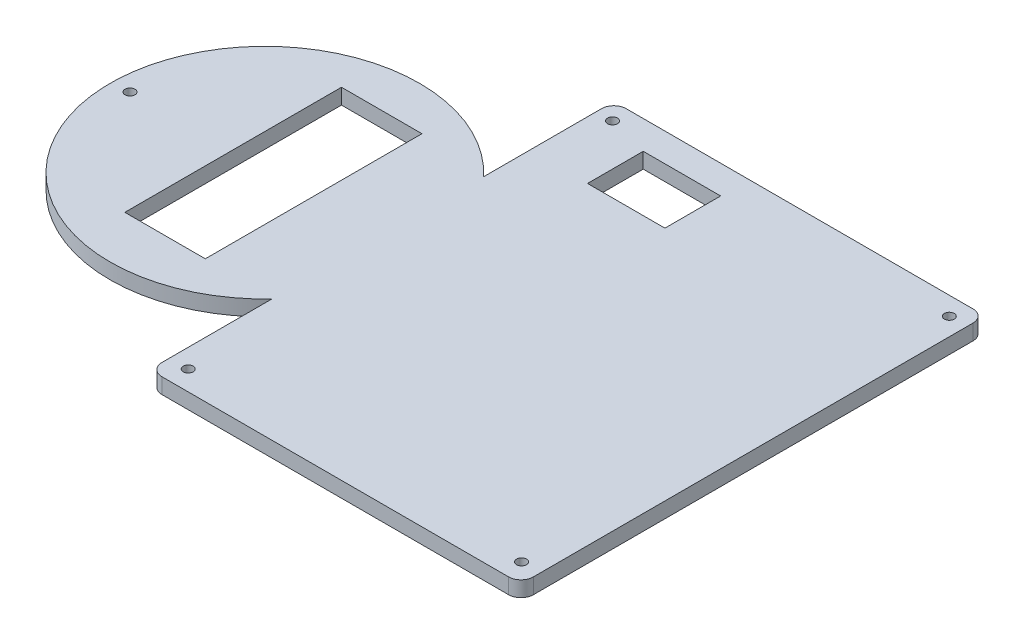
ISO-10303-21;
HEADER;
FILE_DESCRIPTION(('STEP AP214'),'2;1');
FILE_NAME('part.step','',(''),(''),'','','');
FILE_SCHEMA(('AUTOMOTIVE_DESIGN { 1 0 10303 214 1 1 1 1 }'));
ENDSEC;
DATA;
#1=APPLICATION_CONTEXT('core data for automotive mechanical design processes');
#2=APPLICATION_PROTOCOL_DEFINITION('international standard','automotive_design',2000,#1);
#3=PRODUCT_CONTEXT('',#1,'mechanical');
#4=PRODUCT('Part','Part','',(#3));
#5=PRODUCT_RELATED_PRODUCT_CATEGORY('part','',(#4));
#6=PRODUCT_DEFINITION_FORMATION('','',#4);
#7=PRODUCT_DEFINITION_CONTEXT('part definition',#1,'design');
#8=PRODUCT_DEFINITION('design','',#6,#7);
#9=PRODUCT_DEFINITION_SHAPE('','',#8);
#10=(LENGTH_UNIT() NAMED_UNIT(*) SI_UNIT(.MILLI.,.METRE.));
#11=(NAMED_UNIT(*) PLANE_ANGLE_UNIT() SI_UNIT($,.RADIAN.));
#12=(NAMED_UNIT(*) SI_UNIT($,.STERADIAN.) SOLID_ANGLE_UNIT());
#13=UNCERTAINTY_MEASURE_WITH_UNIT(LENGTH_MEASURE(1.E-05),#10,'distance_accuracy_value','');
#14=(GEOMETRIC_REPRESENTATION_CONTEXT(3) GLOBAL_UNCERTAINTY_ASSIGNED_CONTEXT((#13)) GLOBAL_UNIT_ASSIGNED_CONTEXT((#10,
#11,#12)) REPRESENTATION_CONTEXT('',''));
#15=CARTESIAN_POINT('',(0.,0.,0.));
#16=DIRECTION('',(0.,0.,1.));
#17=DIRECTION('',(1.,0.,0.));
#18=AXIS2_PLACEMENT_3D('',#15,#16,#17);
#19=CARTESIAN_POINT('',(13.7088550827018,5.,-147.164227743625));
#20=DIRECTION('',(1.,0.,0.));
#21=DIRECTION('',(0.,0.,-1.));
#22=AXIS2_PLACEMENT_3D('',#19,#20,#21);
#23=PLANE('',#22);
#24=DIRECTION('',(0.,0.,1.));
#25=VECTOR('',#24,1.);
#26=CARTESIAN_POINT('',(13.7088550827018,0.,-147.164227743625));
#27=LINE('',#26,#25);
#28=CARTESIAN_POINT('',(13.7088550827018,0.,-36.700917177434));
#29=VERTEX_POINT('',#28);
#30=CARTESIAN_POINT('',(13.7088550827018,0.,-1.16422774362512));
#31=VERTEX_POINT('',#30);
#32=EDGE_CURVE('E259',#29,#31,#27,.T.);
#33=ORIENTED_EDGE('',*,*,#32,.T.);
#34=DIRECTION('',(0.,-1.,0.));
#35=VECTOR('',#34,1.);
#36=CARTESIAN_POINT('',(13.7088550827018,5.,-1.16422774362512));
#37=LINE('',#36,#35);
#38=CARTESIAN_POINT('',(13.7088550827018,5.,-1.16422774362512));
#39=VERTEX_POINT('',#38);
#40=EDGE_CURVE('E318',#31,#39,#37,.F.);
#41=ORIENTED_EDGE('',*,*,#40,.T.);
#42=DIRECTION('',(0.,0.,1.));
#43=VECTOR('',#42,1.);
#44=CARTESIAN_POINT('',(13.7088550827018,5.,-147.164227743625));
#45=LINE('',#44,#43);
#46=CARTESIAN_POINT('',(13.7088550827018,5.,-36.700917177434));
#47=VERTEX_POINT('',#46);
#48=EDGE_CURVE('E263',#47,#39,#45,.T.);
#49=ORIENTED_EDGE('',*,*,#48,.F.);
#50=DIRECTION('',(0.,-1.,0.));
#51=VECTOR('',#50,1.);
#52=CARTESIAN_POINT('',(13.7088550827018,5.,-36.700917177434));
#53=LINE('',#52,#51);
#54=EDGE_CURVE('E256',#29,#47,#53,.F.);
#55=ORIENTED_EDGE('',*,*,#54,.F.);
#56=EDGE_LOOP('',(#33,#41,#49,#55));
#57=FACE_BOUND('',#56,.T.);
#58=ADVANCED_FACE('F36',(#57),#23,.F.);
#59=CARTESIAN_POINT('',(13.7088550827018,5.,-143.164227743625));
#60=VERTEX_POINT('',#59);
#61=CARTESIAN_POINT('',(13.7088550827018,5.,-105.071550558676));
#62=VERTEX_POINT('',#61);
#63=EDGE_CURVE('E260',#60,#62,#45,.T.);
#64=ORIENTED_EDGE('',*,*,#63,.F.);
#65=DIRECTION('',(0.,-1.,0.));
#66=VECTOR('',#65,1.);
#67=CARTESIAN_POINT('',(13.7088550827018,0.,-143.164227743625));
#68=LINE('',#67,#66);
#69=CARTESIAN_POINT('',(13.7088550827018,0.,-143.164227743625));
#70=VERTEX_POINT('',#69);
#71=EDGE_CURVE('E320',#60,#70,#68,.T.);
#72=ORIENTED_EDGE('',*,*,#71,.T.);
#73=CARTESIAN_POINT('',(13.7088550827018,0.,-105.071550558676));
#74=VERTEX_POINT('',#73);
#75=EDGE_CURVE('E273',#70,#74,#27,.T.);
#76=ORIENTED_EDGE('',*,*,#75,.T.);
#77=DIRECTION('',(0.,-1.,0.));
#78=VECTOR('',#77,1.);
#79=CARTESIAN_POINT('',(13.7088550827018,5.,-105.071550558676));
#80=LINE('',#79,#78);
#81=EDGE_CURVE('E250',#62,#74,#80,.T.);
#82=ORIENTED_EDGE('',*,*,#81,.F.);
#83=EDGE_LOOP('',(#64,#72,#76,#82));
#84=FACE_BOUND('',#83,.T.);
#85=ADVANCED_FACE('F359',(#84),#23,.F.);
#86=CARTESIAN_POINT('',(13.7088550827018,5.,2.83577225637488));
#87=DIRECTION('',(0.,0.,-1.));
#88=DIRECTION('',(-1.,0.,0.));
#89=AXIS2_PLACEMENT_3D('',#86,#87,#88);
#90=PLANE('',#89);
#91=DIRECTION('',(1.,0.,0.));
#92=VECTOR('',#91,1.);
#93=CARTESIAN_POINT('',(13.7088550827018,0.,2.83577225637488));
#94=LINE('',#93,#92);
#95=CARTESIAN_POINT('',(17.7088550827018,0.,2.83577225637488));
#96=VERTEX_POINT('',#95);
#97=CARTESIAN_POINT('',(129.708855082702,0.,2.83577225637488));
#98=VERTEX_POINT('',#97);
#99=EDGE_CURVE('E275',#96,#98,#94,.T.);
#100=ORIENTED_EDGE('',*,*,#99,.T.);
#101=DIRECTION('',(0.,-1.,0.));
#102=VECTOR('',#101,1.);
#103=CARTESIAN_POINT('',(129.708855082702,5.,2.83577225637488));
#104=LINE('',#103,#102);
#105=CARTESIAN_POINT('',(129.708855082702,5.,2.83577225637488));
#106=VERTEX_POINT('',#105);
#107=EDGE_CURVE('E303',#98,#106,#104,.F.);
#108=ORIENTED_EDGE('',*,*,#107,.T.);
#109=DIRECTION('',(1.,0.,0.));
#110=VECTOR('',#109,1.);
#111=CARTESIAN_POINT('',(13.7088550827018,5.,2.83577225637488));
#112=LINE('',#111,#110);
#113=CARTESIAN_POINT('',(17.7088550827018,5.,2.83577225637488));
#114=VERTEX_POINT('',#113);
#115=EDGE_CURVE('E262',#114,#106,#112,.T.);
#116=ORIENTED_EDGE('',*,*,#115,.F.);
#117=DIRECTION('',(0.,-1.,0.));
#118=VECTOR('',#117,1.);
#119=CARTESIAN_POINT('',(17.7088550827018,5.,2.83577225637488));
#120=LINE('',#119,#118);
#121=EDGE_CURVE('E300',#114,#96,#120,.T.);
#122=ORIENTED_EDGE('',*,*,#121,.T.);
#123=EDGE_LOOP('',(#100,#108,#116,#122));
#124=FACE_BOUND('',#123,.T.);
#125=ADVANCED_FACE('F365',(#124),#90,.F.);
#126=CARTESIAN_POINT('',(133.708855082702,5.,-147.164227743625));
#127=DIRECTION('',(1.,0.,0.));
#128=DIRECTION('',(0.,0.,-1.));
#129=AXIS2_PLACEMENT_3D('',#126,#127,#128);
#130=PLANE('',#129);
#131=DIRECTION('',(0.,0.,1.));
#132=VECTOR('',#131,1.);
#133=CARTESIAN_POINT('',(133.708855082702,5.,-147.164227743625));
#134=LINE('',#133,#132);
#135=CARTESIAN_POINT('',(133.708855082702,5.,-143.164227743625));
#136=VERTEX_POINT('',#135);
#137=CARTESIAN_POINT('',(133.708855082702,5.,-1.16422774362512));
#138=VERTEX_POINT('',#137);
#139=EDGE_CURVE('E266',#136,#138,#134,.T.);
#140=ORIENTED_EDGE('',*,*,#139,.T.);
#141=DIRECTION('',(0.,-1.,0.));
#142=VECTOR('',#141,1.);
#143=CARTESIAN_POINT('',(133.708855082702,0.,-1.16422774362512));
#144=LINE('',#143,#142);
#145=CARTESIAN_POINT('',(133.708855082702,0.,-1.16422774362512));
#146=VERTEX_POINT('',#145);
#147=EDGE_CURVE('E289',#138,#146,#144,.T.);
#148=ORIENTED_EDGE('',*,*,#147,.T.);
#149=DIRECTION('',(0.,0.,1.));
#150=VECTOR('',#149,1.);
#151=CARTESIAN_POINT('',(133.708855082702,0.,-147.164227743625));
#152=LINE('',#151,#150);
#153=CARTESIAN_POINT('',(133.708855082702,0.,-143.164227743625));
#154=VERTEX_POINT('',#153);
#155=EDGE_CURVE('E278',#154,#146,#152,.T.);
#156=ORIENTED_EDGE('',*,*,#155,.F.);
#157=DIRECTION('',(0.,-1.,0.));
#158=VECTOR('',#157,1.);
#159=CARTESIAN_POINT('',(133.708855082702,5.,-143.164227743625));
#160=LINE('',#159,#158);
#161=EDGE_CURVE('E272',#154,#136,#160,.F.);
#162=ORIENTED_EDGE('',*,*,#161,.T.);
#163=EDGE_LOOP('',(#140,#148,#156,#162));
#164=FACE_BOUND('',#163,.T.);
#165=ADVANCED_FACE('F401',(#164),#130,.T.);
#166=CARTESIAN_POINT('',(13.7088550827018,5.,-147.164227743625));
#167=DIRECTION('',(0.,0.,-1.));
#168=DIRECTION('',(-1.,0.,0.));
#169=AXIS2_PLACEMENT_3D('',#166,#167,#168);
#170=PLANE('',#169);
#171=DIRECTION('',(1.,0.,0.));
#172=VECTOR('',#171,1.);
#173=CARTESIAN_POINT('',(13.7088550827018,5.,-147.164227743625));
#174=LINE('',#173,#172);
#175=CARTESIAN_POINT('',(17.7088550827018,5.,-147.164227743625));
#176=VERTEX_POINT('',#175);
#177=CARTESIAN_POINT('',(129.708855082702,5.,-147.164227743625));
#178=VERTEX_POINT('',#177);
#179=EDGE_CURVE('E269',#176,#178,#174,.T.);
#180=ORIENTED_EDGE('',*,*,#179,.T.);
#181=DIRECTION('',(0.,-1.,0.));
#182=VECTOR('',#181,1.);
#183=CARTESIAN_POINT('',(129.708855082702,5.,-147.164227743625));
#184=LINE('',#183,#182);
#185=CARTESIAN_POINT('',(129.708855082702,0.,-147.164227743625));
#186=VERTEX_POINT('',#185);
#187=EDGE_CURVE('E315',#178,#186,#184,.T.);
#188=ORIENTED_EDGE('',*,*,#187,.T.);
#189=DIRECTION('',(1.,0.,0.));
#190=VECTOR('',#189,1.);
#191=CARTESIAN_POINT('',(13.7088550827018,0.,-147.164227743625));
#192=LINE('',#191,#190);
#193=CARTESIAN_POINT('',(17.7088550827018,0.,-147.164227743625));
#194=VERTEX_POINT('',#193);
#195=EDGE_CURVE('E281',#194,#186,#192,.T.);
#196=ORIENTED_EDGE('',*,*,#195,.F.);
#197=DIRECTION('',(0.,-1.,0.));
#198=VECTOR('',#197,1.);
#199=CARTESIAN_POINT('',(17.7088550827018,5.,-147.164227743625));
#200=LINE('',#199,#198);
#201=EDGE_CURVE('E313',#194,#176,#200,.F.);
#202=ORIENTED_EDGE('',*,*,#201,.T.);
#203=EDGE_LOOP('',(#180,#188,#196,#202));
#204=FACE_BOUND('',#203,.T.);
#205=ADVANCED_FACE('F408',(#204),#170,.T.);
#206=CARTESIAN_POINT('',(0.,5.,0.));
#207=DIRECTION('',(0.,1.,0.));
#208=DIRECTION('',(0.,0.,1.));
#209=AXIS2_PLACEMENT_3D('',#206,#207,#208);
#210=PLANE('',#209);
#211=DIRECTION('',(0.,0.,-1.));
#212=VECTOR('',#211,1.);
#213=CARTESIAN_POINT('',(57.3758983763834,5.,-137.99167248453));
#214=LINE('',#213,#212);
#215=CARTESIAN_POINT('',(57.3758983763834,5.,-119.99167248453));
#216=VERTEX_POINT('',#215);
#217=CARTESIAN_POINT('',(57.3758983763834,5.,-137.99167248453));
#218=VERTEX_POINT('',#217);
#219=EDGE_CURVE('E51',#216,#218,#214,.T.);
#220=ORIENTED_EDGE('',*,*,#219,.F.);
#221=DIRECTION('',(1.,0.,0.));
#222=VECTOR('',#221,1.);
#223=CARTESIAN_POINT('',(32.3758983763834,5.,-119.99167248453));
#224=LINE('',#223,#222);
#225=CARTESIAN_POINT('',(32.3758983763834,5.,-119.99167248453));
#226=VERTEX_POINT('',#225);
#227=EDGE_CURVE('E180',#226,#216,#224,.T.);
#228=ORIENTED_EDGE('',*,*,#227,.F.);
#229=DIRECTION('',(0.,0.,1.));
#230=VECTOR('',#229,1.);
#231=CARTESIAN_POINT('',(32.3758983763834,5.,-137.99167248453));
#232=LINE('',#231,#230);
#233=CARTESIAN_POINT('',(32.3758983763834,5.,-137.99167248453));
#234=VERTEX_POINT('',#233);
#235=EDGE_CURVE('E164',#234,#226,#232,.T.);
#236=ORIENTED_EDGE('',*,*,#235,.F.);
#237=DIRECTION('',(-1.,0.,0.));
#238=VECTOR('',#237,1.);
#239=CARTESIAN_POINT('',(32.3758983763834,5.,-137.99167248453));
#240=LINE('',#239,#238);
#241=EDGE_CURVE('E173',#218,#234,#240,.T.);
#242=ORIENTED_EDGE('',*,*,#241,.F.);
#243=EDGE_LOOP('',(#220,#228,#236,#242));
#244=FACE_BOUND('',#243,.T.);
#245=DIRECTION('',(0.,0.,-1.));
#246=VECTOR('',#245,1.);
#247=CARTESIAN_POINT('',(-8.2911449172982,5.,-37.1642277436251));
#248=LINE('',#247,#246);
#249=CARTESIAN_POINT('',(-8.2911449172982,5.,-37.1642277436251));
#250=VERTEX_POINT('',#249);
#251=CARTESIAN_POINT('',(-8.2911449172982,5.,-107.164227743625));
#252=VERTEX_POINT('',#251);
#253=EDGE_CURVE('E187',#250,#252,#248,.T.);
#254=ORIENTED_EDGE('',*,*,#253,.F.);
#255=DIRECTION('',(1.,0.,0.));
#256=VECTOR('',#255,1.);
#257=CARTESIAN_POINT('',(-34.2911449172982,5.,-37.1642277436251));
#258=LINE('',#257,#256);
#259=CARTESIAN_POINT('',(-34.2911449172982,5.,-37.1642277436251));
#260=VERTEX_POINT('',#259);
#261=EDGE_CURVE('E197',#260,#250,#258,.T.);
#262=ORIENTED_EDGE('',*,*,#261,.F.);
#263=DIRECTION('',(0.,0.,1.));
#264=VECTOR('',#263,1.);
#265=CARTESIAN_POINT('',(-34.2911449172982,5.,-37.1642277436251));
#266=LINE('',#265,#264);
#267=CARTESIAN_POINT('',(-34.2911449172982,5.,-107.164227743625));
#268=VERTEX_POINT('',#267);
#269=EDGE_CURVE('E194',#268,#260,#266,.T.);
#270=ORIENTED_EDGE('',*,*,#269,.F.);
#271=DIRECTION('',(-1.,0.,0.));
#272=VECTOR('',#271,1.);
#273=CARTESIAN_POINT('',(-34.2911449172982,5.,-107.164227743625));
#274=LINE('',#273,#272);
#275=EDGE_CURVE('E191',#252,#268,#274,.T.);
#276=ORIENTED_EDGE('',*,*,#275,.F.);
#277=EDGE_LOOP('',(#254,#262,#270,#276));
#278=FACE_BOUND('',#277,.T.);
#279=CARTESIAN_POINT('',(18.9171232014785,5.,-141.531370061939));
#280=DIRECTION('',(0.,1.,0.));
#281=DIRECTION('',(0.,0.,1.));
#282=AXIS2_PLACEMENT_3D('',#279,#280,#281);
#283=CIRCLE('',#282,1.6);
#284=CARTESIAN_POINT('',(18.9171232014785,5.,-139.931370061939));
#285=VERTEX_POINT('',#284);
#286=EDGE_CURVE('E203',#285,#285,#283,.T.);
#287=ORIENTED_EDGE('',*,*,#286,.F.);
#288=EDGE_LOOP('',(#287));
#289=FACE_BOUND('',#288,.T.);
#290=CARTESIAN_POINT('',(127.969984406632,5.,-141.269223760965));
#291=DIRECTION('',(0.,1.,0.));
#292=DIRECTION('',(0.,0.,1.));
#293=AXIS2_PLACEMENT_3D('',#290,#291,#292);
#294=CIRCLE('',#293,1.59999999999999);
#295=CARTESIAN_POINT('',(127.969984406632,5.,-139.669223760965));
#296=VERTEX_POINT('',#295);
#297=EDGE_CURVE('E215',#296,#296,#294,.T.);
#298=ORIENTED_EDGE('',*,*,#297,.F.);
#299=EDGE_LOOP('',(#298));
#300=FACE_BOUND('',#299,.T.);
#301=CARTESIAN_POINT('',(127.602547563754,5.,-3.45328248038996));
#302=DIRECTION('',(0.,1.,0.));
#303=DIRECTION('',(0.,0.,1.));
#304=AXIS2_PLACEMENT_3D('',#301,#302,#303);
#305=CIRCLE('',#304,1.59999999999999);
#306=CARTESIAN_POINT('',(127.602547563754,5.,-1.85328248038997));
#307=VERTEX_POINT('',#306);
#308=EDGE_CURVE('E221',#307,#307,#305,.T.);
#309=ORIENTED_EDGE('',*,*,#308,.F.);
#310=EDGE_LOOP('',(#309));
#311=FACE_BOUND('',#310,.T.);
#312=CARTESIAN_POINT('',(19.774147178092,5.,-3.57057546629467));
#313=DIRECTION('',(0.,1.,0.));
#314=DIRECTION('',(0.,0.,1.));
#315=AXIS2_PLACEMENT_3D('',#312,#313,#314);
#316=CIRCLE('',#315,1.6);
#317=CARTESIAN_POINT('',(19.774147178092,5.,-1.97057546629467));
#318=VERTEX_POINT('',#317);
#319=EDGE_CURVE('E227',#318,#318,#316,.T.);
#320=ORIENTED_EDGE('',*,*,#319,.F.);
#321=EDGE_LOOP('',(#320));
#322=FACE_BOUND('',#321,.T.);
#323=CARTESIAN_POINT('',(-67.1156180642389,5.,-71.6687404961348));
#324=DIRECTION('',(0.,1.,0.));
#325=DIRECTION('',(0.,0.,1.));
#326=AXIS2_PLACEMENT_3D('',#323,#324,#325);
#327=CIRCLE('',#326,1.6);
#328=CARTESIAN_POINT('',(-67.1156180642389,5.,-70.0687404961348));
#329=VERTEX_POINT('',#328);
#330=EDGE_CURVE('E233',#329,#329,#327,.T.);
#331=ORIENTED_EDGE('',*,*,#330,.F.);
#332=EDGE_LOOP('',(#331));
#333=FACE_BOUND('',#332,.T.);
#334=ORIENTED_EDGE('',*,*,#115,.T.);
#335=CARTESIAN_POINT('',(129.708855082702,5.,-1.16422774362512));
#336=DIRECTION('',(0.,1.,0.));
#337=DIRECTION('',(0.,0.,1.));
#338=AXIS2_PLACEMENT_3D('',#335,#336,#337);
#339=CIRCLE('',#338,4.);
#340=EDGE_CURVE('E311',#106,#138,#339,.T.);
#341=ORIENTED_EDGE('',*,*,#340,.T.);
#342=ORIENTED_EDGE('',*,*,#139,.F.);
#343=CARTESIAN_POINT('',(129.708855082702,5.,-143.164227743625));
#344=DIRECTION('',(0.,1.,0.));
#345=DIRECTION('',(0.,0.,1.));
#346=AXIS2_PLACEMENT_3D('',#343,#344,#345);
#347=CIRCLE('',#346,4.);
#348=EDGE_CURVE('E309',#136,#178,#347,.T.);
#349=ORIENTED_EDGE('',*,*,#348,.T.);
#350=ORIENTED_EDGE('',*,*,#179,.F.);
#351=CARTESIAN_POINT('',(17.7088550827018,5.,-143.164227743625));
#352=DIRECTION('',(0.,1.,0.));
#353=DIRECTION('',(0.,0.,1.));
#354=AXIS2_PLACEMENT_3D('',#351,#352,#353);
#355=CIRCLE('',#354,4.);
#356=EDGE_CURVE('E305',#176,#60,#355,.T.);
#357=ORIENTED_EDGE('',*,*,#356,.T.);
#358=ORIENTED_EDGE('',*,*,#63,.T.);
#359=CARTESIAN_POINT('',(-22.7790075946593,5.,-70.8862338680548));
#360=DIRECTION('',(0.,1.,0.));
#361=DIRECTION('',(0.,0.,1.));
#362=AXIS2_PLACEMENT_3D('',#359,#360,#361);
#363=CIRCLE('',#362,50.);
#364=EDGE_CURVE('E247',#62,#47,#363,.T.);
#365=ORIENTED_EDGE('',*,*,#364,.T.);
#366=ORIENTED_EDGE('',*,*,#48,.T.);
#367=CARTESIAN_POINT('',(17.7088550827018,5.,-1.16422774362512));
#368=DIRECTION('',(0.,1.,0.));
#369=DIRECTION('',(0.,0.,1.));
#370=AXIS2_PLACEMENT_3D('',#367,#368,#369);
#371=CIRCLE('',#370,4.);
#372=EDGE_CURVE('E307',#39,#114,#371,.T.);
#373=ORIENTED_EDGE('',*,*,#372,.T.);
#374=EDGE_LOOP('',(#334,#341,#342,#349,#350,#357,#358,#365,#366,#373));
#375=FACE_BOUND('',#374,.T.);
#376=ADVANCED_FACE('F177',(#244,#278,#289,#300,#311,#322,#333,#375),#210,.T.);
#377=CARTESIAN_POINT('',(0.,0.,0.));
#378=DIRECTION('',(0.,1.,0.));
#379=DIRECTION('',(0.,0.,1.));
#380=AXIS2_PLACEMENT_3D('',#377,#378,#379);
#381=PLANE('',#380);
#382=DIRECTION('',(1.,0.,0.));
#383=VECTOR('',#382,1.);
#384=CARTESIAN_POINT('',(0.,0.,-119.99167248453));
#385=LINE('',#384,#383);
#386=CARTESIAN_POINT('',(32.3758983763834,0.,-119.99167248453));
#387=VERTEX_POINT('',#386);
#388=CARTESIAN_POINT('',(57.3758983763834,0.,-119.99167248453));
#389=VERTEX_POINT('',#388);
#390=EDGE_CURVE('E44',#387,#389,#385,.T.);
#391=ORIENTED_EDGE('',*,*,#390,.T.);
#392=DIRECTION('',(0.,0.,-1.));
#393=VECTOR('',#392,1.);
#394=CARTESIAN_POINT('',(57.3758983763834,0.,0.));
#395=LINE('',#394,#393);
#396=CARTESIAN_POINT('',(57.3758983763834,0.,-137.99167248453));
#397=VERTEX_POINT('',#396);
#398=EDGE_CURVE('E11',#389,#397,#395,.T.);
#399=ORIENTED_EDGE('',*,*,#398,.T.);
#400=DIRECTION('',(-1.,0.,0.));
#401=VECTOR('',#400,1.);
#402=CARTESIAN_POINT('',(0.,0.,-137.99167248453));
#403=LINE('',#402,#401);
#404=CARTESIAN_POINT('',(32.3758983763834,0.,-137.99167248453));
#405=VERTEX_POINT('',#404);
#406=EDGE_CURVE('E335',#397,#405,#403,.T.);
#407=ORIENTED_EDGE('',*,*,#406,.T.);
#408=DIRECTION('',(0.,0.,1.));
#409=VECTOR('',#408,1.);
#410=CARTESIAN_POINT('',(32.3758983763834,0.,0.));
#411=LINE('',#410,#409);
#412=EDGE_CURVE('E167',#405,#387,#411,.T.);
#413=ORIENTED_EDGE('',*,*,#412,.T.);
#414=EDGE_LOOP('',(#391,#399,#407,#413));
#415=FACE_BOUND('',#414,.T.);
#416=DIRECTION('',(1.,0.,0.));
#417=VECTOR('',#416,1.);
#418=CARTESIAN_POINT('',(0.,0.,-37.1642277436251));
#419=LINE('',#418,#417);
#420=CARTESIAN_POINT('',(-34.2911449172982,0.,-37.1642277436251));
#421=VERTEX_POINT('',#420);
#422=CARTESIAN_POINT('',(-8.2911449172982,0.,-37.1642277436251));
#423=VERTEX_POINT('',#422);
#424=EDGE_CURVE('E329',#421,#423,#419,.T.);
#425=ORIENTED_EDGE('',*,*,#424,.T.);
#426=DIRECTION('',(0.,0.,-1.));
#427=VECTOR('',#426,1.);
#428=CARTESIAN_POINT('',(-8.2911449172982,0.,0.));
#429=LINE('',#428,#427);
#430=CARTESIAN_POINT('',(-8.2911449172982,0.,-107.164227743625));
#431=VERTEX_POINT('',#430);
#432=EDGE_CURVE('E332',#423,#431,#429,.T.);
#433=ORIENTED_EDGE('',*,*,#432,.T.);
#434=DIRECTION('',(-1.,0.,0.));
#435=VECTOR('',#434,1.);
#436=CARTESIAN_POINT('',(0.,0.,-107.164227743625));
#437=LINE('',#436,#435);
#438=CARTESIAN_POINT('',(-34.2911449172982,0.,-107.164227743625));
#439=VERTEX_POINT('',#438);
#440=EDGE_CURVE('E323',#431,#439,#437,.T.);
#441=ORIENTED_EDGE('',*,*,#440,.T.);
#442=DIRECTION('',(0.,0.,1.));
#443=VECTOR('',#442,1.);
#444=CARTESIAN_POINT('',(-34.2911449172982,0.,0.));
#445=LINE('',#444,#443);
#446=EDGE_CURVE('E326',#439,#421,#445,.T.);
#447=ORIENTED_EDGE('',*,*,#446,.T.);
#448=EDGE_LOOP('',(#425,#433,#441,#447));
#449=FACE_BOUND('',#448,.T.);
#450=CARTESIAN_POINT('',(18.9171232014785,0.,-141.531370061939));
#451=DIRECTION('',(0.,1.,0.));
#452=DIRECTION('',(0.,0.,1.));
#453=AXIS2_PLACEMENT_3D('',#450,#451,#452);
#454=CIRCLE('',#453,1.6);
#455=CARTESIAN_POINT('',(18.9171232014785,0.,-139.931370061939));
#456=VERTEX_POINT('',#455);
#457=EDGE_CURVE('E212',#456,#456,#454,.T.);
#458=ORIENTED_EDGE('',*,*,#457,.T.);
#459=EDGE_LOOP('',(#458));
#460=FACE_BOUND('',#459,.T.);
#461=CARTESIAN_POINT('',(127.602547563754,0.,-3.45328248038996));
#462=DIRECTION('',(0.,1.,0.));
#463=DIRECTION('',(0.,0.,1.));
#464=AXIS2_PLACEMENT_3D('',#461,#462,#463);
#465=CIRCLE('',#464,1.59999999999999);
#466=CARTESIAN_POINT('',(127.602547563754,0.,-1.85328248038997));
#467=VERTEX_POINT('',#466);
#468=EDGE_CURVE('E224',#467,#467,#465,.T.);
#469=ORIENTED_EDGE('',*,*,#468,.T.);
#470=EDGE_LOOP('',(#469));
#471=FACE_BOUND('',#470,.T.);
#472=CARTESIAN_POINT('',(-67.1156180642389,0.,-71.6687404961348));
#473=DIRECTION('',(0.,1.,0.));
#474=DIRECTION('',(0.,0.,1.));
#475=AXIS2_PLACEMENT_3D('',#472,#473,#474);
#476=CIRCLE('',#475,1.6);
#477=CARTESIAN_POINT('',(-67.1156180642389,0.,-70.0687404961348));
#478=VERTEX_POINT('',#477);
#479=EDGE_CURVE('E236',#478,#478,#476,.T.);
#480=ORIENTED_EDGE('',*,*,#479,.T.);
#481=EDGE_LOOP('',(#480));
#482=FACE_BOUND('',#481,.T.);
#483=CARTESIAN_POINT('',(127.708855082702,0.,-141.164227743625));
#484=DIRECTION('',(0.,1.,0.));
#485=DIRECTION('',(0.,0.,1.));
#486=AXIS2_PLACEMENT_3D('',#483,#484,#485);
#487=CIRCLE('',#486,2.99999999999999);
#488=CARTESIAN_POINT('',(127.708855082702,0.,-138.164227743625));
#489=VERTEX_POINT('',#488);
#490=EDGE_CURVE('E242',#489,#489,#487,.T.);
#491=ORIENTED_EDGE('',*,*,#490,.T.);
#492=EDGE_LOOP('',(#491));
#493=FACE_BOUND('',#492,.T.);
#494=CARTESIAN_POINT('',(19.7088550827018,0.,-3.16422774362512));
#495=DIRECTION('',(0.,1.,0.));
#496=DIRECTION('',(0.,0.,1.));
#497=AXIS2_PLACEMENT_3D('',#494,#495,#496);
#498=CIRCLE('',#497,3.);
#499=CARTESIAN_POINT('',(19.7088550827018,0.,-0.164227743625117));
#500=VERTEX_POINT('',#499);
#501=EDGE_CURVE('E246',#500,#500,#498,.F.);
#502=ORIENTED_EDGE('',*,*,#501,.F.);
#503=EDGE_LOOP('',(#502));
#504=FACE_BOUND('',#503,.T.);
#505=ORIENTED_EDGE('',*,*,#155,.T.);
#506=CARTESIAN_POINT('',(129.708855082702,0.,-1.16422774362512));
#507=DIRECTION('',(0.,1.,0.));
#508=DIRECTION('',(0.,0.,1.));
#509=AXIS2_PLACEMENT_3D('',#506,#507,#508);
#510=CIRCLE('',#509,4.);
#511=EDGE_CURVE('E298',#146,#98,#510,.F.);
#512=ORIENTED_EDGE('',*,*,#511,.T.);
#513=ORIENTED_EDGE('',*,*,#99,.F.);
#514=CARTESIAN_POINT('',(17.7088550827018,0.,-1.16422774362512));
#515=DIRECTION('',(0.,1.,0.));
#516=DIRECTION('',(0.,0.,1.));
#517=AXIS2_PLACEMENT_3D('',#514,#515,#516);
#518=CIRCLE('',#517,4.);
#519=EDGE_CURVE('E294',#96,#31,#518,.F.);
#520=ORIENTED_EDGE('',*,*,#519,.T.);
#521=ORIENTED_EDGE('',*,*,#32,.F.);
#522=CARTESIAN_POINT('',(-22.7790075946593,0.,-70.8862338680548));
#523=DIRECTION('',(0.,1.,0.));
#524=DIRECTION('',(0.,0.,1.));
#525=AXIS2_PLACEMENT_3D('',#522,#523,#524);
#526=CIRCLE('',#525,50.);
#527=EDGE_CURVE('E251',#74,#29,#526,.T.);
#528=ORIENTED_EDGE('',*,*,#527,.F.);
#529=ORIENTED_EDGE('',*,*,#75,.F.);
#530=CARTESIAN_POINT('',(17.7088550827018,0.,-143.164227743625));
#531=DIRECTION('',(0.,1.,0.));
#532=DIRECTION('',(0.,0.,1.));
#533=AXIS2_PLACEMENT_3D('',#530,#531,#532);
#534=CIRCLE('',#533,4.);
#535=EDGE_CURVE('E292',#70,#194,#534,.F.);
#536=ORIENTED_EDGE('',*,*,#535,.T.);
#537=ORIENTED_EDGE('',*,*,#195,.T.);
#538=CARTESIAN_POINT('',(129.708855082702,0.,-143.164227743625));
#539=DIRECTION('',(0.,1.,0.));
#540=DIRECTION('',(0.,0.,1.));
#541=AXIS2_PLACEMENT_3D('',#538,#539,#540);
#542=CIRCLE('',#541,4.);
#543=EDGE_CURVE('E296',#186,#154,#542,.F.);
#544=ORIENTED_EDGE('',*,*,#543,.T.);
#545=EDGE_LOOP('',(#505,#512,#513,#520,#521,#528,#529,#536,#537,#544));
#546=FACE_BOUND('',#545,.T.);
#547=ADVANCED_FACE('F339',(#415,#449,#460,#471,#482,#493,#504,#546),#381,.F.);
#548=CARTESIAN_POINT('',(-22.7790075946593,5.,-70.8862338680548));
#549=DIRECTION('',(0.,-1.,0.));
#550=DIRECTION('',(0.,0.,-1.));
#551=AXIS2_PLACEMENT_3D('',#548,#549,#550);
#552=CYLINDRICAL_SURFACE('',#551,50.);
#553=ORIENTED_EDGE('',*,*,#527,.T.);
#554=ORIENTED_EDGE('',*,*,#54,.T.);
#555=ORIENTED_EDGE('',*,*,#364,.F.);
#556=ORIENTED_EDGE('',*,*,#81,.T.);
#557=EDGE_LOOP('',(#553,#554,#555,#556));
#558=FACE_BOUND('',#557,.T.);
#559=ADVANCED_FACE('F418',(#558),#552,.T.);
#560=CARTESIAN_POINT('',(19.7088550827018,0.0001,-3.16422774362512));
#561=DIRECTION('',(0.,-1.,0.));
#562=DIRECTION('',(0.,0.,-1.));
#563=AXIS2_PLACEMENT_3D('',#560,#561,#562);
#564=CYLINDRICAL_SURFACE('',#563,3.);
#565=CARTESIAN_POINT('',(19.7088550827018,0.0001,-3.16422774362512));
#566=DIRECTION('',(0.,1.,0.));
#567=DIRECTION('',(0.,0.,1.));
#568=AXIS2_PLACEMENT_3D('',#565,#566,#567);
#569=CIRCLE('',#568,3.);
#570=CARTESIAN_POINT('',(19.7088550827018,0.0001,-0.164227743625117));
#571=VERTEX_POINT('',#570);
#572=EDGE_CURVE('E243',#571,#571,#569,.T.);
#573=ORIENTED_EDGE('',*,*,#572,.T.);
#574=EDGE_LOOP('',(#573));
#575=FACE_BOUND('',#574,.T.);
#576=ORIENTED_EDGE('',*,*,#501,.T.);
#577=EDGE_LOOP('',(#576));
#578=FACE_BOUND('',#577,.T.);
#579=ADVANCED_FACE('F427',(#575,#578),#564,.F.);
#580=CARTESIAN_POINT('',(19.7088550827018,0.0001,-3.16422774362512));
#581=DIRECTION('',(0.,1.,0.));
#582=DIRECTION('',(0.,0.,1.));
#583=AXIS2_PLACEMENT_3D('',#580,#581,#582);
#584=PLANE('',#583);
#585=CARTESIAN_POINT('',(19.774147178092,0.000100000000000273,-3.57057546629467));
#586=DIRECTION('',(0.,1.,0.));
#587=DIRECTION('',(0.,0.,1.));
#588=AXIS2_PLACEMENT_3D('',#585,#586,#587);
#589=CIRCLE('',#588,1.6);
#590=CARTESIAN_POINT('',(19.774147178092,0.000100000000000273,-1.97057546629467));
#591=VERTEX_POINT('',#590);
#592=EDGE_CURVE('E230',#591,#591,#589,.T.);
#593=ORIENTED_EDGE('',*,*,#592,.T.);
#594=EDGE_LOOP('',(#593));
#595=FACE_BOUND('',#594,.T.);
#596=ORIENTED_EDGE('',*,*,#572,.F.);
#597=EDGE_LOOP('',(#596));
#598=FACE_BOUND('',#597,.T.);
#599=ADVANCED_FACE('F517',(#595,#598),#584,.F.);
#600=CARTESIAN_POINT('',(127.708855082702,-0.999999999999986,-141.164227743625));
#601=DIRECTION('',(0.,1.,0.));
#602=DIRECTION('',(0.,0.,1.));
#603=AXIS2_PLACEMENT_3D('',#600,#601,#602);
#604=CYLINDRICAL_SURFACE('',#603,2.99999999999999);
#605=CARTESIAN_POINT('',(127.708855082702,0.01,-141.164227743625));
#606=DIRECTION('',(0.,1.,0.));
#607=DIRECTION('',(0.,0.,1.));
#608=AXIS2_PLACEMENT_3D('',#605,#606,#607);
#609=CIRCLE('',#608,2.99999999999999);
#610=CARTESIAN_POINT('',(127.708855082702,0.01,-138.164227743625));
#611=VERTEX_POINT('',#610);
#612=EDGE_CURVE('E239',#611,#611,#609,.T.);
#613=ORIENTED_EDGE('',*,*,#612,.T.);
#614=EDGE_LOOP('',(#613));
#615=FACE_BOUND('',#614,.T.);
#616=ORIENTED_EDGE('',*,*,#490,.F.);
#617=EDGE_LOOP('',(#616));
#618=FACE_BOUND('',#617,.T.);
#619=ADVANCED_FACE('F509',(#615,#618),#604,.F.);
#620=CARTESIAN_POINT('',(127.708855082702,0.01,-141.164227743625));
#621=DIRECTION('',(0.,1.,0.));
#622=DIRECTION('',(0.,0.,1.));
#623=AXIS2_PLACEMENT_3D('',#620,#621,#622);
#624=PLANE('',#623);
#625=CARTESIAN_POINT('',(127.969984406632,0.00999999999999959,-141.269223760965));
#626=DIRECTION('',(0.,1.,0.));
#627=DIRECTION('',(0.,0.,1.));
#628=AXIS2_PLACEMENT_3D('',#625,#626,#627);
#629=CIRCLE('',#628,1.59999999999999);
#630=CARTESIAN_POINT('',(127.969984406632,0.00999999999999959,-139.669223760965));
#631=VERTEX_POINT('',#630);
#632=EDGE_CURVE('E218',#631,#631,#629,.T.);
#633=ORIENTED_EDGE('',*,*,#632,.T.);
#634=EDGE_LOOP('',(#633));
#635=FACE_BOUND('',#634,.T.);
#636=ORIENTED_EDGE('',*,*,#612,.F.);
#637=EDGE_LOOP('',(#636));
#638=FACE_BOUND('',#637,.T.);
#639=ADVANCED_FACE('F499',(#635,#638),#624,.F.);
#640=CARTESIAN_POINT('',(-67.1156180642389,5.,-71.6687404961348));
#641=DIRECTION('',(0.,1.,0.));
#642=DIRECTION('',(0.,0.,1.));
#643=AXIS2_PLACEMENT_3D('',#640,#641,#642);
#644=CYLINDRICAL_SURFACE('',#643,1.6);
#645=ORIENTED_EDGE('',*,*,#479,.F.);
#646=EDGE_LOOP('',(#645));
#647=FACE_BOUND('',#646,.T.);
#648=ORIENTED_EDGE('',*,*,#330,.T.);
#649=EDGE_LOOP('',(#648));
#650=FACE_BOUND('',#649,.T.);
#651=ADVANCED_FACE('F489',(#647,#650),#644,.F.);
#652=CARTESIAN_POINT('',(19.774147178092,5.,-3.57057546629467));
#653=DIRECTION('',(0.,1.,0.));
#654=DIRECTION('',(0.,0.,1.));
#655=AXIS2_PLACEMENT_3D('',#652,#653,#654);
#656=CYLINDRICAL_SURFACE('',#655,1.6);
#657=ORIENTED_EDGE('',*,*,#319,.T.);
#658=EDGE_LOOP('',(#657));
#659=FACE_BOUND('',#658,.T.);
#660=ORIENTED_EDGE('',*,*,#592,.F.);
#661=EDGE_LOOP('',(#660));
#662=FACE_BOUND('',#661,.T.);
#663=ADVANCED_FACE('F479',(#659,#662),#656,.F.);
#664=CARTESIAN_POINT('',(127.602547563754,5.,-3.45328248038996));
#665=DIRECTION('',(0.,1.,0.));
#666=DIRECTION('',(0.,0.,1.));
#667=AXIS2_PLACEMENT_3D('',#664,#665,#666);
#668=CYLINDRICAL_SURFACE('',#667,1.59999999999999);
#669=ORIENTED_EDGE('',*,*,#468,.F.);
#670=EDGE_LOOP('',(#669));
#671=FACE_BOUND('',#670,.T.);
#672=ORIENTED_EDGE('',*,*,#308,.T.);
#673=EDGE_LOOP('',(#672));
#674=FACE_BOUND('',#673,.T.);
#675=ADVANCED_FACE('F469',(#671,#674),#668,.F.);
#676=CARTESIAN_POINT('',(127.969984406632,5.,-141.269223760965));
#677=DIRECTION('',(0.,1.,0.));
#678=DIRECTION('',(0.,0.,1.));
#679=AXIS2_PLACEMENT_3D('',#676,#677,#678);
#680=CYLINDRICAL_SURFACE('',#679,1.59999999999999);
#681=ORIENTED_EDGE('',*,*,#297,.T.);
#682=EDGE_LOOP('',(#681));
#683=FACE_BOUND('',#682,.T.);
#684=ORIENTED_EDGE('',*,*,#632,.F.);
#685=EDGE_LOOP('',(#684));
#686=FACE_BOUND('',#685,.T.);
#687=ADVANCED_FACE('F458',(#683,#686),#680,.F.);
#688=CARTESIAN_POINT('',(18.9171232014785,5.,-141.531370061939));
#689=DIRECTION('',(0.,1.,0.));
#690=DIRECTION('',(0.,0.,1.));
#691=AXIS2_PLACEMENT_3D('',#688,#689,#690);
#692=CYLINDRICAL_SURFACE('',#691,1.6);
#693=ORIENTED_EDGE('',*,*,#457,.F.);
#694=EDGE_LOOP('',(#693));
#695=FACE_BOUND('',#694,.T.);
#696=ORIENTED_EDGE('',*,*,#286,.T.);
#697=EDGE_LOOP('',(#696));
#698=FACE_BOUND('',#697,.T.);
#699=ADVANCED_FACE('F375',(#695,#698),#692,.F.);
#700=CARTESIAN_POINT('',(129.708855082702,5.,-1.16422774362512));
#701=DIRECTION('',(0.,1.,0.));
#702=DIRECTION('',(0.,0.,1.));
#703=AXIS2_PLACEMENT_3D('',#700,#701,#702);
#704=CYLINDRICAL_SURFACE('',#703,4.);
#705=ORIENTED_EDGE('',*,*,#340,.F.);
#706=ORIENTED_EDGE('',*,*,#107,.F.);
#707=ORIENTED_EDGE('',*,*,#511,.F.);
#708=ORIENTED_EDGE('',*,*,#147,.F.);
#709=EDGE_LOOP('',(#705,#706,#707,#708));
#710=FACE_BOUND('',#709,.T.);
#711=ADVANCED_FACE('F371',(#710),#704,.T.);
#712=CARTESIAN_POINT('',(129.708855082702,5.,-143.164227743625));
#713=DIRECTION('',(0.,-1.,0.));
#714=DIRECTION('',(0.,0.,-1.));
#715=AXIS2_PLACEMENT_3D('',#712,#713,#714);
#716=CYLINDRICAL_SURFACE('',#715,4.);
#717=ORIENTED_EDGE('',*,*,#348,.F.);
#718=ORIENTED_EDGE('',*,*,#161,.F.);
#719=ORIENTED_EDGE('',*,*,#543,.F.);
#720=ORIENTED_EDGE('',*,*,#187,.F.);
#721=EDGE_LOOP('',(#717,#718,#719,#720));
#722=FACE_BOUND('',#721,.T.);
#723=ADVANCED_FACE('F374',(#722),#716,.T.);
#724=CARTESIAN_POINT('',(17.7088550827018,5.,-1.16422774362512));
#725=DIRECTION('',(0.,-1.,0.));
#726=DIRECTION('',(0.,0.,-1.));
#727=AXIS2_PLACEMENT_3D('',#724,#725,#726);
#728=CYLINDRICAL_SURFACE('',#727,4.);
#729=ORIENTED_EDGE('',*,*,#372,.F.);
#730=ORIENTED_EDGE('',*,*,#40,.F.);
#731=ORIENTED_EDGE('',*,*,#519,.F.);
#732=ORIENTED_EDGE('',*,*,#121,.F.);
#733=EDGE_LOOP('',(#729,#730,#731,#732));
#734=FACE_BOUND('',#733,.T.);
#735=ADVANCED_FACE('F378',(#734),#728,.T.);
#736=CARTESIAN_POINT('',(17.7088550827018,5.,-143.164227743625));
#737=DIRECTION('',(0.,1.,0.));
#738=DIRECTION('',(0.,0.,1.));
#739=AXIS2_PLACEMENT_3D('',#736,#737,#738);
#740=CYLINDRICAL_SURFACE('',#739,4.);
#741=ORIENTED_EDGE('',*,*,#356,.F.);
#742=ORIENTED_EDGE('',*,*,#201,.F.);
#743=ORIENTED_EDGE('',*,*,#535,.F.);
#744=ORIENTED_EDGE('',*,*,#71,.F.);
#745=EDGE_LOOP('',(#741,#742,#743,#744));
#746=FACE_BOUND('',#745,.T.);
#747=ADVANCED_FACE('F38',(#746),#740,.T.);
#748=CARTESIAN_POINT('',(-8.2911449172982,-35.,-37.1642277436251));
#749=DIRECTION('',(1.,0.,0.));
#750=DIRECTION('',(0.,0.,-1.));
#751=AXIS2_PLACEMENT_3D('',#748,#749,#750);
#752=PLANE('',#751);
#753=DIRECTION('',(0.,1.,0.));
#754=VECTOR('',#753,1.);
#755=CARTESIAN_POINT('',(-8.2911449172982,-35.,-37.1642277436251));
#756=LINE('',#755,#754);
#757=EDGE_CURVE('E201',#423,#250,#756,.T.);
#758=ORIENTED_EDGE('',*,*,#757,.T.);
#759=ORIENTED_EDGE('',*,*,#253,.T.);
#760=DIRECTION('',(0.,1.,0.));
#761=VECTOR('',#760,1.);
#762=CARTESIAN_POINT('',(-8.2911449172982,-35.,-107.164227743625));
#763=LINE('',#762,#761);
#764=EDGE_CURVE('E200',#431,#252,#763,.T.);
#765=ORIENTED_EDGE('',*,*,#764,.F.);
#766=ORIENTED_EDGE('',*,*,#432,.F.);
#767=EDGE_LOOP('',(#758,#759,#765,#766));
#768=FACE_BOUND('',#767,.T.);
#769=ADVANCED_FACE('F385',(#768),#752,.F.);
#770=CARTESIAN_POINT('',(-34.2911449172982,-35.,-37.1642277436251));
#771=DIRECTION('',(0.,0.,1.));
#772=DIRECTION('',(1.,0.,0.));
#773=AXIS2_PLACEMENT_3D('',#770,#771,#772);
#774=PLANE('',#773);
#775=DIRECTION('',(0.,1.,0.));
#776=VECTOR('',#775,1.);
#777=CARTESIAN_POINT('',(-34.2911449172982,-35.,-37.1642277436251));
#778=LINE('',#777,#776);
#779=EDGE_CURVE('E204',#421,#260,#778,.T.);
#780=ORIENTED_EDGE('',*,*,#779,.T.);
#781=ORIENTED_EDGE('',*,*,#261,.T.);
#782=ORIENTED_EDGE('',*,*,#757,.F.);
#783=ORIENTED_EDGE('',*,*,#424,.F.);
#784=EDGE_LOOP('',(#780,#781,#782,#783));
#785=FACE_BOUND('',#784,.T.);
#786=ADVANCED_FACE('F575',(#785),#774,.F.);
#787=CARTESIAN_POINT('',(-34.2911449172982,-35.,-37.1642277436251));
#788=DIRECTION('',(-1.,0.,0.));
#789=DIRECTION('',(0.,0.,1.));
#790=AXIS2_PLACEMENT_3D('',#787,#788,#789);
#791=PLANE('',#790);
#792=DIRECTION('',(0.,1.,0.));
#793=VECTOR('',#792,1.);
#794=CARTESIAN_POINT('',(-34.2911449172982,-35.,-107.164227743625));
#795=LINE('',#794,#793);
#796=EDGE_CURVE('E206',#439,#268,#795,.T.);
#797=ORIENTED_EDGE('',*,*,#796,.T.);
#798=ORIENTED_EDGE('',*,*,#269,.T.);
#799=ORIENTED_EDGE('',*,*,#779,.F.);
#800=ORIENTED_EDGE('',*,*,#446,.F.);
#801=EDGE_LOOP('',(#797,#798,#799,#800));
#802=FACE_BOUND('',#801,.T.);
#803=ADVANCED_FACE('F353',(#802),#791,.F.);
#804=CARTESIAN_POINT('',(-34.2911449172982,-35.,-107.164227743625));
#805=DIRECTION('',(0.,0.,-1.));
#806=DIRECTION('',(-1.,0.,0.));
#807=AXIS2_PLACEMENT_3D('',#804,#805,#806);
#808=PLANE('',#807);
#809=ORIENTED_EDGE('',*,*,#764,.T.);
#810=ORIENTED_EDGE('',*,*,#275,.T.);
#811=ORIENTED_EDGE('',*,*,#796,.F.);
#812=ORIENTED_EDGE('',*,*,#440,.F.);
#813=EDGE_LOOP('',(#809,#810,#811,#812));
#814=FACE_BOUND('',#813,.T.);
#815=ADVANCED_FACE('F346',(#814),#808,.F.);
#816=CARTESIAN_POINT('',(57.3758983763834,-35.,-137.99167248453));
#817=DIRECTION('',(1.,0.,0.));
#818=DIRECTION('',(0.,0.,-1.));
#819=AXIS2_PLACEMENT_3D('',#816,#817,#818);
#820=PLANE('',#819);
#821=DIRECTION('',(0.,1.,0.));
#822=VECTOR('',#821,1.);
#823=CARTESIAN_POINT('',(57.3758983763834,-35.,-119.99167248453));
#824=LINE('',#823,#822);
#825=EDGE_CURVE('E185',#389,#216,#824,.T.);
#826=ORIENTED_EDGE('',*,*,#825,.T.);
#827=ORIENTED_EDGE('',*,*,#219,.T.);
#828=DIRECTION('',(0.,1.,0.));
#829=VECTOR('',#828,1.);
#830=CARTESIAN_POINT('',(57.3758983763834,-35.,-137.99167248453));
#831=LINE('',#830,#829);
#832=EDGE_CURVE('E170',#397,#218,#831,.T.);
#833=ORIENTED_EDGE('',*,*,#832,.F.);
#834=ORIENTED_EDGE('',*,*,#398,.F.);
#835=EDGE_LOOP('',(#826,#827,#833,#834));
#836=FACE_BOUND('',#835,.T.);
#837=ADVANCED_FACE('F344',(#836),#820,.F.);
#838=CARTESIAN_POINT('',(32.3758983763834,-35.,-119.99167248453));
#839=DIRECTION('',(0.,0.,1.));
#840=DIRECTION('',(1.,0.,0.));
#841=AXIS2_PLACEMENT_3D('',#838,#839,#840);
#842=PLANE('',#841);
#843=DIRECTION('',(0.,1.,0.));
#844=VECTOR('',#843,1.);
#845=CARTESIAN_POINT('',(32.3758983763834,-35.,-119.99167248453));
#846=LINE('',#845,#844);
#847=EDGE_CURVE('E169',#387,#226,#846,.T.);
#848=ORIENTED_EDGE('',*,*,#847,.T.);
#849=ORIENTED_EDGE('',*,*,#227,.T.);
#850=ORIENTED_EDGE('',*,*,#825,.F.);
#851=ORIENTED_EDGE('',*,*,#390,.F.);
#852=EDGE_LOOP('',(#848,#849,#850,#851));
#853=FACE_BOUND('',#852,.T.);
#854=ADVANCED_FACE('F343',(#853),#842,.F.);
#855=CARTESIAN_POINT('',(32.3758983763834,-35.,-137.99167248453));
#856=DIRECTION('',(-1.,0.,0.));
#857=DIRECTION('',(0.,0.,1.));
#858=AXIS2_PLACEMENT_3D('',#855,#856,#857);
#859=PLANE('',#858);
#860=DIRECTION('',(0.,1.,0.));
#861=VECTOR('',#860,1.);
#862=CARTESIAN_POINT('',(32.3758983763834,-35.,-137.99167248453));
#863=LINE('',#862,#861);
#864=EDGE_CURVE('E59',#405,#234,#863,.T.);
#865=ORIENTED_EDGE('',*,*,#864,.T.);
#866=ORIENTED_EDGE('',*,*,#235,.T.);
#867=ORIENTED_EDGE('',*,*,#847,.F.);
#868=ORIENTED_EDGE('',*,*,#412,.F.);
#869=EDGE_LOOP('',(#865,#866,#867,#868));
#870=FACE_BOUND('',#869,.T.);
#871=ADVANCED_FACE('F161',(#870),#859,.F.);
#872=CARTESIAN_POINT('',(32.3758983763834,-35.,-137.99167248453));
#873=DIRECTION('',(0.,0.,-1.));
#874=DIRECTION('',(-1.,0.,0.));
#875=AXIS2_PLACEMENT_3D('',#872,#873,#874);
#876=PLANE('',#875);
#877=ORIENTED_EDGE('',*,*,#832,.T.);
#878=ORIENTED_EDGE('',*,*,#241,.T.);
#879=ORIENTED_EDGE('',*,*,#864,.F.);
#880=ORIENTED_EDGE('',*,*,#406,.F.);
#881=EDGE_LOOP('',(#877,#878,#879,#880));
#882=FACE_BOUND('',#881,.T.);
#883=ADVANCED_FACE('F174',(#882),#876,.F.);
#884=CLOSED_SHELL('',(#58,#85,#125,#165,#205,#376,#547,#559,#579,#599,#619,#639,#651,#663,#675,
#687,#699,#711,#723,#735,#747,#769,#786,#803,#815,#837,#854,#871,#883));
#885=MANIFOLD_SOLID_BREP('B2',#884);
#886=ADVANCED_BREP_SHAPE_REPRESENTATION('',(#18,#885),#14);
#887=SHAPE_DEFINITION_REPRESENTATION(#9,#886);
ENDSEC;
END-ISO-10303-21;
